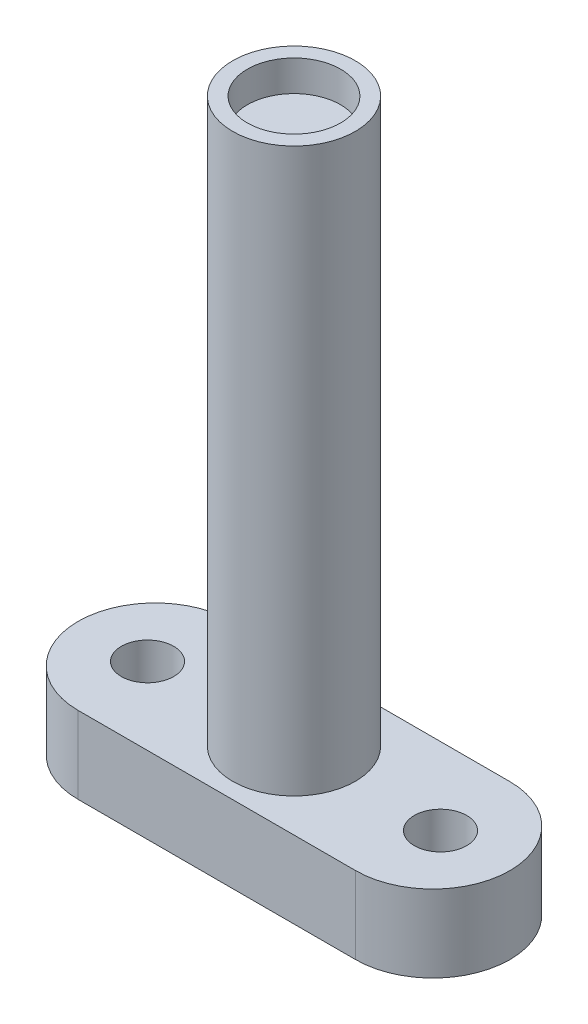
ISO-10303-21;
HEADER;
FILE_DESCRIPTION(('STEP AP214'),'2;1');
FILE_NAME('part.step','',(''),(''),'','','');
FILE_SCHEMA(('AUTOMOTIVE_DESIGN { 1 0 10303 214 1 1 1 1 }'));
ENDSEC;
DATA;
#1=APPLICATION_CONTEXT('core data for automotive mechanical design processes');
#2=APPLICATION_PROTOCOL_DEFINITION('international standard','automotive_design',2000,#1);
#3=PRODUCT_CONTEXT('',#1,'mechanical');
#4=PRODUCT('Part','Part','',(#3));
#5=PRODUCT_RELATED_PRODUCT_CATEGORY('part','',(#4));
#6=PRODUCT_DEFINITION_FORMATION('','',#4);
#7=PRODUCT_DEFINITION_CONTEXT('part definition',#1,'design');
#8=PRODUCT_DEFINITION('design','',#6,#7);
#9=PRODUCT_DEFINITION_SHAPE('','',#8);
#10=(LENGTH_UNIT() NAMED_UNIT(*) SI_UNIT(.MILLI.,.METRE.));
#11=(NAMED_UNIT(*) PLANE_ANGLE_UNIT() SI_UNIT($,.RADIAN.));
#12=(NAMED_UNIT(*) SI_UNIT($,.STERADIAN.) SOLID_ANGLE_UNIT());
#13=UNCERTAINTY_MEASURE_WITH_UNIT(LENGTH_MEASURE(1.E-05),#10,'distance_accuracy_value','');
#14=(GEOMETRIC_REPRESENTATION_CONTEXT(3) GLOBAL_UNCERTAINTY_ASSIGNED_CONTEXT((#13)) GLOBAL_UNIT_ASSIGNED_CONTEXT((#10,
#11,#12)) REPRESENTATION_CONTEXT('',''));
#15=CARTESIAN_POINT('',(0.,0.,0.));
#16=DIRECTION('',(0.,0.,1.));
#17=DIRECTION('',(1.,0.,0.));
#18=AXIS2_PLACEMENT_3D('',#15,#16,#17);
#19=CARTESIAN_POINT('',(-9.,0.,0.));
#20=DIRECTION('',(0.,1.,0.));
#21=DIRECTION('',(0.,0.,1.));
#22=AXIS2_PLACEMENT_3D('',#19,#20,#21);
#23=PLANE('',#22);
#24=CARTESIAN_POINT('',(-9.,0.,0.));
#25=DIRECTION('',(0.,1.,0.));
#26=DIRECTION('',(0.,0.,1.));
#27=AXIS2_PLACEMENT_3D('',#24,#25,#26);
#28=CIRCLE('',#27,5.);
#29=CARTESIAN_POINT('',(-9.,0.,-5.));
#30=VERTEX_POINT('',#29);
#31=CARTESIAN_POINT('',(-9.,0.,5.));
#32=VERTEX_POINT('',#31);
#33=EDGE_CURVE('E114',#30,#32,#28,.T.);
#34=ORIENTED_EDGE('',*,*,#33,.F.);
#35=DIRECTION('',(-1.,0.,0.));
#36=VECTOR('',#35,1.);
#37=CARTESIAN_POINT('',(-9.,0.,-5.));
#38=LINE('',#37,#36);
#39=CARTESIAN_POINT('',(9.,0.,-5.));
#40=VERTEX_POINT('',#39);
#41=EDGE_CURVE('E86',#40,#30,#38,.T.);
#42=ORIENTED_EDGE('',*,*,#41,.F.);
#43=CARTESIAN_POINT('',(9.,0.,0.));
#44=DIRECTION('',(0.,1.,0.));
#45=DIRECTION('',(0.,0.,1.));
#46=AXIS2_PLACEMENT_3D('',#43,#44,#45);
#47=CIRCLE('',#46,5.);
#48=CARTESIAN_POINT('',(9.,0.,5.));
#49=VERTEX_POINT('',#48);
#50=EDGE_CURVE('E80',#49,#40,#47,.T.);
#51=ORIENTED_EDGE('',*,*,#50,.F.);
#52=DIRECTION('',(1.,0.,0.));
#53=VECTOR('',#52,1.);
#54=CARTESIAN_POINT('',(-9.,0.,5.));
#55=LINE('',#54,#53);
#56=EDGE_CURVE('E103',#32,#49,#55,.T.);
#57=ORIENTED_EDGE('',*,*,#56,.F.);
#58=EDGE_LOOP('',(#34,#42,#51,#57));
#59=FACE_BOUND('',#58,.T.);
#60=CARTESIAN_POINT('',(9.5,0.,0.));
#61=DIRECTION('',(0.,1.,0.));
#62=DIRECTION('',(0.,0.,1.));
#63=AXIS2_PLACEMENT_3D('',#60,#61,#62);
#64=CIRCLE('',#63,1.7);
#65=CARTESIAN_POINT('',(9.5,0.,1.69999999999999));
#66=VERTEX_POINT('',#65);
#67=EDGE_CURVE('E118',#66,#66,#64,.F.);
#68=ORIENTED_EDGE('',*,*,#67,.F.);
#69=EDGE_LOOP('',(#68));
#70=FACE_BOUND('',#69,.T.);
#71=CARTESIAN_POINT('',(-9.5,0.,0.));
#72=DIRECTION('',(0.,1.,0.));
#73=DIRECTION('',(0.,0.,1.));
#74=AXIS2_PLACEMENT_3D('',#71,#72,#73);
#75=CIRCLE('',#74,1.7);
#76=CARTESIAN_POINT('',(-9.5,0.,1.7));
#77=VERTEX_POINT('',#76);
#78=EDGE_CURVE('E139',#77,#77,#75,.F.);
#79=ORIENTED_EDGE('',*,*,#78,.F.);
#80=EDGE_LOOP('',(#79));
#81=FACE_BOUND('',#80,.T.);
#82=ADVANCED_FACE('F45',(#59,#70,#81),#23,.F.);
#83=CARTESIAN_POINT('',(-9.,5.,0.));
#84=DIRECTION('',(0.,-1.,0.));
#85=DIRECTION('',(0.,0.,-1.));
#86=AXIS2_PLACEMENT_3D('',#83,#84,#85);
#87=CYLINDRICAL_SURFACE('',#86,5.);
#88=ORIENTED_EDGE('',*,*,#33,.T.);
#89=DIRECTION('',(0.,-1.,0.));
#90=VECTOR('',#89,1.);
#91=CARTESIAN_POINT('',(-9.,5.,5.));
#92=LINE('',#91,#90);
#93=CARTESIAN_POINT('',(-9.,5.,5.));
#94=VERTEX_POINT('',#93);
#95=EDGE_CURVE('E11',#94,#32,#92,.T.);
#96=ORIENTED_EDGE('',*,*,#95,.F.);
#97=CARTESIAN_POINT('',(-9.,5.,0.));
#98=DIRECTION('',(0.,1.,0.));
#99=DIRECTION('',(0.,0.,1.));
#100=AXIS2_PLACEMENT_3D('',#97,#98,#99);
#101=CIRCLE('',#100,5.);
#102=CARTESIAN_POINT('',(-9.,5.,-5.));
#103=VERTEX_POINT('',#102);
#104=EDGE_CURVE('E98',#103,#94,#101,.T.);
#105=ORIENTED_EDGE('',*,*,#104,.F.);
#106=DIRECTION('',(0.,-1.,0.));
#107=VECTOR('',#106,1.);
#108=CARTESIAN_POINT('',(-9.,5.,-5.));
#109=LINE('',#108,#107);
#110=EDGE_CURVE('E110',#103,#30,#109,.T.);
#111=ORIENTED_EDGE('',*,*,#110,.T.);
#112=EDGE_LOOP('',(#88,#96,#105,#111));
#113=FACE_BOUND('',#112,.T.);
#114=ADVANCED_FACE('F47',(#113),#87,.T.);
#115=CARTESIAN_POINT('',(-9.,5.,5.));
#116=DIRECTION('',(0.,0.,-1.));
#117=DIRECTION('',(-1.,0.,0.));
#118=AXIS2_PLACEMENT_3D('',#115,#116,#117);
#119=PLANE('',#118);
#120=ORIENTED_EDGE('',*,*,#56,.T.);
#121=DIRECTION('',(0.,-1.,0.));
#122=VECTOR('',#121,1.);
#123=CARTESIAN_POINT('',(9.,5.,5.));
#124=LINE('',#123,#122);
#125=CARTESIAN_POINT('',(9.,5.,5.));
#126=VERTEX_POINT('',#125);
#127=EDGE_CURVE('E55',#126,#49,#124,.T.);
#128=ORIENTED_EDGE('',*,*,#127,.F.);
#129=DIRECTION('',(1.,0.,0.));
#130=VECTOR('',#129,1.);
#131=CARTESIAN_POINT('',(-9.,5.,5.));
#132=LINE('',#131,#130);
#133=EDGE_CURVE('E93',#94,#126,#132,.T.);
#134=ORIENTED_EDGE('',*,*,#133,.F.);
#135=ORIENTED_EDGE('',*,*,#95,.T.);
#136=EDGE_LOOP('',(#120,#128,#134,#135));
#137=FACE_BOUND('',#136,.T.);
#138=ADVANCED_FACE('F102',(#137),#119,.F.);
#139=CARTESIAN_POINT('',(9.,5.,0.));
#140=DIRECTION('',(0.,-1.,0.));
#141=DIRECTION('',(0.,0.,-1.));
#142=AXIS2_PLACEMENT_3D('',#139,#140,#141);
#143=CYLINDRICAL_SURFACE('',#142,5.);
#144=ORIENTED_EDGE('',*,*,#50,.T.);
#145=DIRECTION('',(0.,-1.,0.));
#146=VECTOR('',#145,1.);
#147=CARTESIAN_POINT('',(9.,5.,-5.));
#148=LINE('',#147,#146);
#149=CARTESIAN_POINT('',(9.,5.,-5.));
#150=VERTEX_POINT('',#149);
#151=EDGE_CURVE('E105',#150,#40,#148,.T.);
#152=ORIENTED_EDGE('',*,*,#151,.F.);
#153=CARTESIAN_POINT('',(9.,5.,0.));
#154=DIRECTION('',(0.,1.,0.));
#155=DIRECTION('',(0.,0.,1.));
#156=AXIS2_PLACEMENT_3D('',#153,#154,#155);
#157=CIRCLE('',#156,5.);
#158=EDGE_CURVE('E96',#126,#150,#157,.T.);
#159=ORIENTED_EDGE('',*,*,#158,.F.);
#160=ORIENTED_EDGE('',*,*,#127,.T.);
#161=EDGE_LOOP('',(#144,#152,#159,#160));
#162=FACE_BOUND('',#161,.T.);
#163=ADVANCED_FACE('F106',(#162),#143,.T.);
#164=CARTESIAN_POINT('',(-9.,5.,-5.));
#165=DIRECTION('',(0.,0.,1.));
#166=DIRECTION('',(1.,0.,0.));
#167=AXIS2_PLACEMENT_3D('',#164,#165,#166);
#168=PLANE('',#167);
#169=ORIENTED_EDGE('',*,*,#41,.T.);
#170=ORIENTED_EDGE('',*,*,#110,.F.);
#171=DIRECTION('',(-1.,0.,0.));
#172=VECTOR('',#171,1.);
#173=CARTESIAN_POINT('',(-9.,5.,-5.));
#174=LINE('',#173,#172);
#175=EDGE_CURVE('E63',#150,#103,#174,.T.);
#176=ORIENTED_EDGE('',*,*,#175,.F.);
#177=ORIENTED_EDGE('',*,*,#151,.T.);
#178=EDGE_LOOP('',(#169,#170,#176,#177));
#179=FACE_BOUND('',#178,.T.);
#180=ADVANCED_FACE('F128',(#179),#168,.F.);
#181=CARTESIAN_POINT('',(-9.,5.,0.));
#182=DIRECTION('',(0.,1.,0.));
#183=DIRECTION('',(0.,0.,1.));
#184=AXIS2_PLACEMENT_3D('',#181,#182,#183);
#185=PLANE('',#184);
#186=CARTESIAN_POINT('',(0.,5.,0.));
#187=DIRECTION('',(0.,1.,0.));
#188=DIRECTION('',(0.,0.,1.));
#189=AXIS2_PLACEMENT_3D('',#186,#187,#188);
#190=CIRCLE('',#189,3.975);
#191=CARTESIAN_POINT('',(0.,5.,3.975));
#192=VERTEX_POINT('',#191);
#193=EDGE_CURVE('E151',#192,#192,#190,.T.);
#194=ORIENTED_EDGE('',*,*,#193,.F.);
#195=EDGE_LOOP('',(#194));
#196=FACE_BOUND('',#195,.T.);
#197=CARTESIAN_POINT('',(-9.5,5.,0.));
#198=DIRECTION('',(0.,1.,0.));
#199=DIRECTION('',(0.,0.,1.));
#200=AXIS2_PLACEMENT_3D('',#197,#198,#199);
#201=CIRCLE('',#200,1.7);
#202=CARTESIAN_POINT('',(-9.5,5.,1.7));
#203=VERTEX_POINT('',#202);
#204=EDGE_CURVE('E143',#203,#203,#201,.T.);
#205=ORIENTED_EDGE('',*,*,#204,.F.);
#206=EDGE_LOOP('',(#205));
#207=FACE_BOUND('',#206,.T.);
#208=CARTESIAN_POINT('',(9.5,5.,0.));
#209=DIRECTION('',(0.,1.,0.));
#210=DIRECTION('',(0.,0.,1.));
#211=AXIS2_PLACEMENT_3D('',#208,#209,#210);
#212=CIRCLE('',#211,1.7);
#213=CARTESIAN_POINT('',(9.5,5.,1.69999999999999));
#214=VERTEX_POINT('',#213);
#215=EDGE_CURVE('E135',#214,#214,#212,.T.);
#216=ORIENTED_EDGE('',*,*,#215,.F.);
#217=EDGE_LOOP('',(#216));
#218=FACE_BOUND('',#217,.T.);
#219=ORIENTED_EDGE('',*,*,#104,.T.);
#220=ORIENTED_EDGE('',*,*,#133,.T.);
#221=ORIENTED_EDGE('',*,*,#158,.T.);
#222=ORIENTED_EDGE('',*,*,#175,.T.);
#223=EDGE_LOOP('',(#219,#220,#221,#222));
#224=FACE_BOUND('',#223,.T.);
#225=ADVANCED_FACE('F94',(#196,#207,#218,#224),#185,.T.);
#226=CARTESIAN_POINT('',(9.5,5.,0.));
#227=DIRECTION('',(0.,1.,0.));
#228=DIRECTION('',(0.,0.,1.));
#229=AXIS2_PLACEMENT_3D('',#226,#227,#228);
#230=CYLINDRICAL_SURFACE('',#229,1.7);
#231=ORIENTED_EDGE('',*,*,#67,.T.);
#232=EDGE_LOOP('',(#231));
#233=FACE_BOUND('',#232,.T.);
#234=ORIENTED_EDGE('',*,*,#215,.T.);
#235=EDGE_LOOP('',(#234));
#236=FACE_BOUND('',#235,.T.);
#237=ADVANCED_FACE('F190',(#233,#236),#230,.F.);
#238=CARTESIAN_POINT('',(-9.5,5.,0.));
#239=DIRECTION('',(0.,1.,0.));
#240=DIRECTION('',(0.,0.,1.));
#241=AXIS2_PLACEMENT_3D('',#238,#239,#240);
#242=CYLINDRICAL_SURFACE('',#241,1.7);
#243=ORIENTED_EDGE('',*,*,#78,.T.);
#244=EDGE_LOOP('',(#243));
#245=FACE_BOUND('',#244,.T.);
#246=ORIENTED_EDGE('',*,*,#204,.T.);
#247=EDGE_LOOP('',(#246));
#248=FACE_BOUND('',#247,.T.);
#249=ADVANCED_FACE('F184',(#245,#248),#242,.F.);
#250=CARTESIAN_POINT('',(0.,41.5,0.));
#251=DIRECTION('',(0.,-1.,0.));
#252=DIRECTION('',(0.,0.,-1.));
#253=AXIS2_PLACEMENT_3D('',#250,#251,#252);
#254=CYLINDRICAL_SURFACE('',#253,3.975);
#255=CARTESIAN_POINT('',(0.,41.5,0.));
#256=DIRECTION('',(0.,1.,0.));
#257=DIRECTION('',(0.,0.,1.));
#258=AXIS2_PLACEMENT_3D('',#255,#256,#257);
#259=CIRCLE('',#258,3.975);
#260=CARTESIAN_POINT('',(0.,41.5,3.975));
#261=VERTEX_POINT('',#260);
#262=EDGE_CURVE('E147',#261,#261,#259,.T.);
#263=ORIENTED_EDGE('',*,*,#262,.F.);
#264=EDGE_LOOP('',(#263));
#265=FACE_BOUND('',#264,.T.);
#266=ORIENTED_EDGE('',*,*,#193,.T.);
#267=EDGE_LOOP('',(#266));
#268=FACE_BOUND('',#267,.T.);
#269=ADVANCED_FACE('F178',(#265,#268),#254,.T.);
#270=CARTESIAN_POINT('',(0.,41.5,0.));
#271=DIRECTION('',(0.,1.,0.));
#272=DIRECTION('',(0.,0.,1.));
#273=AXIS2_PLACEMENT_3D('',#270,#271,#272);
#274=PLANE('',#273);
#275=CARTESIAN_POINT('',(0.,41.5,0.));
#276=DIRECTION('',(0.,1.,0.));
#277=DIRECTION('',(0.,0.,1.));
#278=AXIS2_PLACEMENT_3D('',#275,#276,#277);
#279=CIRCLE('',#278,3.025);
#280=CARTESIAN_POINT('',(0.,41.5,3.025));
#281=VERTEX_POINT('',#280);
#282=EDGE_CURVE('E159',#281,#281,#279,.T.);
#283=ORIENTED_EDGE('',*,*,#282,.F.);
#284=EDGE_LOOP('',(#283));
#285=FACE_BOUND('',#284,.T.);
#286=ORIENTED_EDGE('',*,*,#262,.T.);
#287=EDGE_LOOP('',(#286));
#288=FACE_BOUND('',#287,.T.);
#289=ADVANCED_FACE('F172',(#285,#288),#274,.T.);
#290=CARTESIAN_POINT('',(0.,39.5,0.));
#291=DIRECTION('',(0.,1.,0.));
#292=DIRECTION('',(0.,0.,1.));
#293=AXIS2_PLACEMENT_3D('',#290,#291,#292);
#294=CYLINDRICAL_SURFACE('',#293,3.025);
#295=CARTESIAN_POINT('',(0.,39.5,0.));
#296=DIRECTION('',(0.,1.,0.));
#297=DIRECTION('',(0.,0.,1.));
#298=AXIS2_PLACEMENT_3D('',#295,#296,#297);
#299=CIRCLE('',#298,3.025);
#300=CARTESIAN_POINT('',(0.,39.5,3.025));
#301=VERTEX_POINT('',#300);
#302=EDGE_CURVE('E155',#301,#301,#299,.T.);
#303=ORIENTED_EDGE('',*,*,#302,.F.);
#304=EDGE_LOOP('',(#303));
#305=FACE_BOUND('',#304,.T.);
#306=ORIENTED_EDGE('',*,*,#282,.T.);
#307=EDGE_LOOP('',(#306));
#308=FACE_BOUND('',#307,.T.);
#309=ADVANCED_FACE('F169',(#305,#308),#294,.F.);
#310=CARTESIAN_POINT('',(0.,39.5,0.));
#311=DIRECTION('',(0.,1.,0.));
#312=DIRECTION('',(0.,0.,1.));
#313=AXIS2_PLACEMENT_3D('',#310,#311,#312);
#314=PLANE('',#313);
#315=ORIENTED_EDGE('',*,*,#302,.T.);
#316=EDGE_LOOP('',(#315));
#317=FACE_BOUND('',#316,.T.);
#318=ADVANCED_FACE('F167',(#317),#314,.T.);
#319=CLOSED_SHELL('',(#82,#114,#138,#163,#180,#225,#237,#249,#269,#289,#309,#318));
#320=MANIFOLD_SOLID_BREP('B2',#319);
#321=ADVANCED_BREP_SHAPE_REPRESENTATION('',(#18,#320),#14);
#322=SHAPE_DEFINITION_REPRESENTATION(#9,#321);
ENDSEC;
END-ISO-10303-21;
